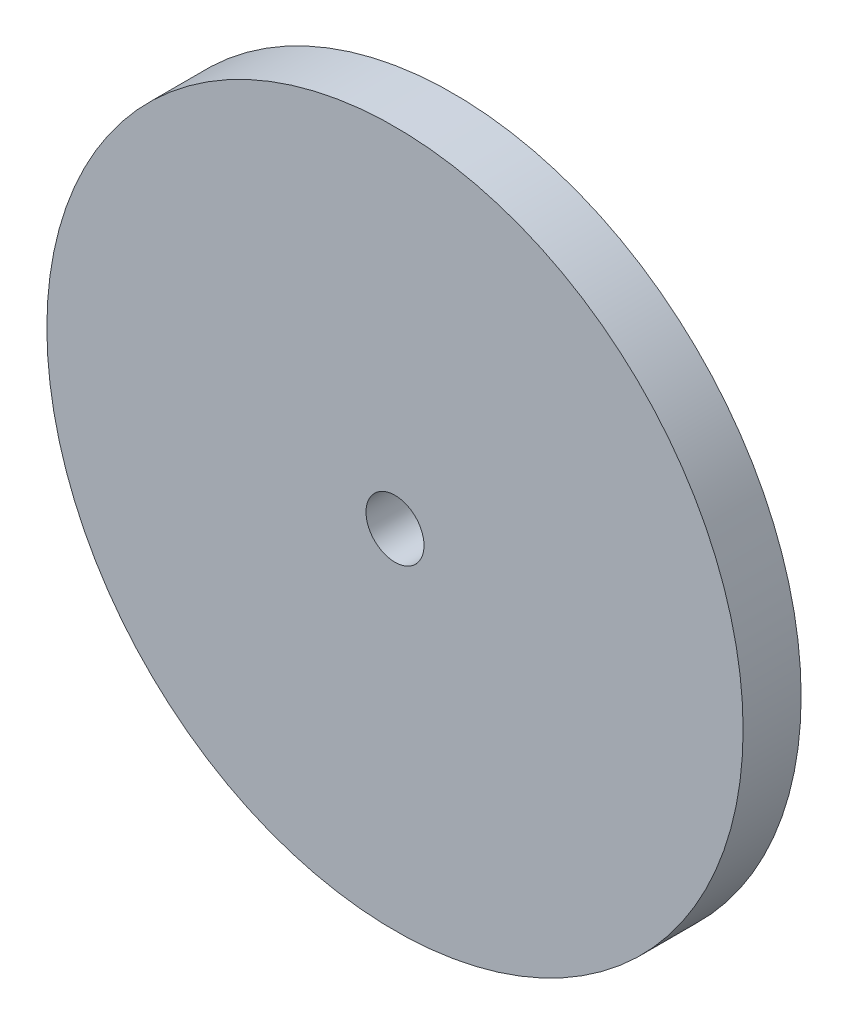
ISO-10303-21;
HEADER;
FILE_DESCRIPTION(('STEP AP214'),'2;1');
FILE_NAME('part.step','',(''),(''),'','','');
FILE_SCHEMA(('AUTOMOTIVE_DESIGN { 1 0 10303 214 1 1 1 1 }'));
ENDSEC;
DATA;
#1=APPLICATION_CONTEXT('core data for automotive mechanical design processes');
#2=APPLICATION_PROTOCOL_DEFINITION('international standard','automotive_design',2000,#1);
#3=PRODUCT_CONTEXT('',#1,'mechanical');
#4=PRODUCT('Part','Part','',(#3));
#5=PRODUCT_RELATED_PRODUCT_CATEGORY('part','',(#4));
#6=PRODUCT_DEFINITION_FORMATION('','',#4);
#7=PRODUCT_DEFINITION_CONTEXT('part definition',#1,'design');
#8=PRODUCT_DEFINITION('design','',#6,#7);
#9=PRODUCT_DEFINITION_SHAPE('','',#8);
#10=(LENGTH_UNIT() NAMED_UNIT(*) SI_UNIT(.MILLI.,.METRE.));
#11=(NAMED_UNIT(*) PLANE_ANGLE_UNIT() SI_UNIT($,.RADIAN.));
#12=(NAMED_UNIT(*) SI_UNIT($,.STERADIAN.) SOLID_ANGLE_UNIT());
#13=UNCERTAINTY_MEASURE_WITH_UNIT(LENGTH_MEASURE(1.E-05),#10,'distance_accuracy_value','');
#14=(GEOMETRIC_REPRESENTATION_CONTEXT(3) GLOBAL_UNCERTAINTY_ASSIGNED_CONTEXT((#13)) GLOBAL_UNIT_ASSIGNED_CONTEXT((#10,
#11,#12)) REPRESENTATION_CONTEXT('',''));
#15=CARTESIAN_POINT('',(0.,0.,0.));
#16=DIRECTION('',(0.,0.,1.));
#17=DIRECTION('',(1.,0.,0.));
#18=AXIS2_PLACEMENT_3D('',#15,#16,#17);
#19=CARTESIAN_POINT('',(0.,0.,6.35));
#20=DIRECTION('',(0.,0.,1.));
#21=DIRECTION('',(1.,0.,0.));
#22=AXIS2_PLACEMENT_3D('',#19,#20,#21);
#23=PLANE('',#22);
#24=CARTESIAN_POINT('',(0.,0.,6.35));
#25=DIRECTION('',(0.,0.,1.));
#26=DIRECTION('',(1.,0.,0.));
#27=AXIS2_PLACEMENT_3D('',#24,#25,#26);
#28=CIRCLE('',#27,38.1);
#29=CARTESIAN_POINT('',(38.1,0.,6.35));
#30=VERTEX_POINT('',#29);
#31=EDGE_CURVE('E10',#30,#30,#28,.T.);
#32=ORIENTED_EDGE('',*,*,#31,.T.);
#33=EDGE_LOOP('',(#32));
#34=FACE_BOUND('',#33,.T.);
#35=CARTESIAN_POINT('',(0.,0.,6.35));
#36=DIRECTION('',(0.,0.,1.));
#37=DIRECTION('',(1.,0.,0.));
#38=AXIS2_PLACEMENT_3D('',#35,#36,#37);
#39=CIRCLE('',#38,3.175);
#40=CARTESIAN_POINT('',(3.175,0.,6.35));
#41=VERTEX_POINT('',#40);
#42=EDGE_CURVE('E45',#41,#41,#39,.T.);
#43=ORIENTED_EDGE('',*,*,#42,.F.);
#44=EDGE_LOOP('',(#43));
#45=FACE_BOUND('',#44,.T.);
#46=ADVANCED_FACE('F34',(#34,#45),#23,.T.);
#47=CARTESIAN_POINT('',(0.,0.,0.));
#48=DIRECTION('',(0.,0.,1.));
#49=DIRECTION('',(1.,0.,0.));
#50=AXIS2_PLACEMENT_3D('',#47,#48,#49);
#51=PLANE('',#50);
#52=CARTESIAN_POINT('',(0.,0.,0.));
#53=DIRECTION('',(0.,0.,1.));
#54=DIRECTION('',(1.,0.,0.));
#55=AXIS2_PLACEMENT_3D('',#52,#53,#54);
#56=CIRCLE('',#55,38.1);
#57=CARTESIAN_POINT('',(38.1,0.,0.));
#58=VERTEX_POINT('',#57);
#59=EDGE_CURVE('E38',#58,#58,#56,.T.);
#60=ORIENTED_EDGE('',*,*,#59,.F.);
#61=EDGE_LOOP('',(#60));
#62=FACE_BOUND('',#61,.T.);
#63=CARTESIAN_POINT('',(0.,0.,0.));
#64=DIRECTION('',(0.,0.,1.));
#65=DIRECTION('',(1.,0.,0.));
#66=AXIS2_PLACEMENT_3D('',#63,#64,#65);
#67=CIRCLE('',#66,3.175);
#68=CARTESIAN_POINT('',(3.175,0.,0.));
#69=VERTEX_POINT('',#68);
#70=EDGE_CURVE('E47',#69,#69,#67,.T.);
#71=ORIENTED_EDGE('',*,*,#70,.T.);
#72=EDGE_LOOP('',(#71));
#73=FACE_BOUND('',#72,.T.);
#74=ADVANCED_FACE('F57',(#62,#73),#51,.F.);
#75=CARTESIAN_POINT('',(0.,0.,6.35));
#76=DIRECTION('',(0.,0.,-1.));
#77=DIRECTION('',(-1.,0.,0.));
#78=AXIS2_PLACEMENT_3D('',#75,#76,#77);
#79=CYLINDRICAL_SURFACE('',#78,38.1);
#80=ORIENTED_EDGE('',*,*,#31,.F.);
#81=EDGE_LOOP('',(#80));
#82=FACE_BOUND('',#81,.T.);
#83=ORIENTED_EDGE('',*,*,#59,.T.);
#84=EDGE_LOOP('',(#83));
#85=FACE_BOUND('',#84,.T.);
#86=ADVANCED_FACE('F36',(#82,#85),#79,.T.);
#87=CARTESIAN_POINT('',(0.,0.,6.35));
#88=DIRECTION('',(0.,0.,-1.));
#89=DIRECTION('',(-1.,0.,0.));
#90=AXIS2_PLACEMENT_3D('',#87,#88,#89);
#91=CYLINDRICAL_SURFACE('',#90,3.175);
#92=ORIENTED_EDGE('',*,*,#42,.T.);
#93=EDGE_LOOP('',(#92));
#94=FACE_BOUND('',#93,.T.);
#95=ORIENTED_EDGE('',*,*,#70,.F.);
#96=EDGE_LOOP('',(#95));
#97=FACE_BOUND('',#96,.T.);
#98=ADVANCED_FACE('F53',(#94,#97),#91,.F.);
#99=CLOSED_SHELL('',(#46,#74,#86,#98));
#100=MANIFOLD_SOLID_BREP('B2',#99);
#101=ADVANCED_BREP_SHAPE_REPRESENTATION('',(#18,#100),#14);
#102=SHAPE_DEFINITION_REPRESENTATION(#9,#101);
ENDSEC;
END-ISO-10303-21;
